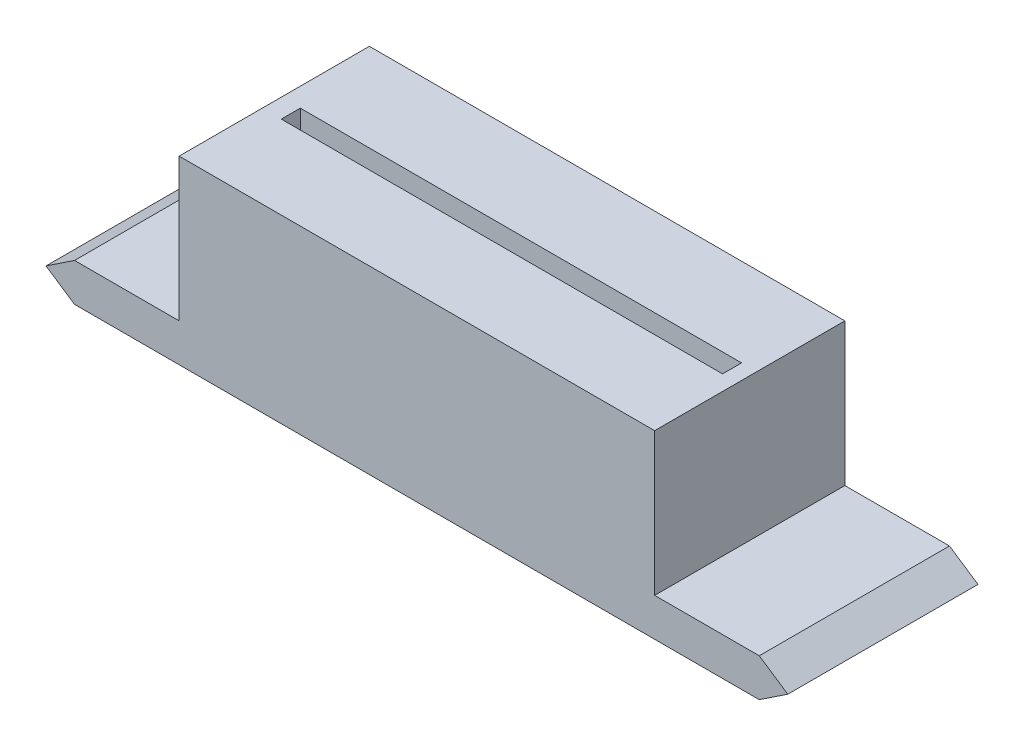
ISO-10303-21;
HEADER;
FILE_DESCRIPTION(('STEP AP214'),'2;1');
FILE_NAME('part.step','',(''),(''),'','','');
FILE_SCHEMA(('AUTOMOTIVE_DESIGN { 1 0 10303 214 1 1 1 1 }'));
ENDSEC;
DATA;
#1=APPLICATION_CONTEXT('core data for automotive mechanical design processes');
#2=APPLICATION_PROTOCOL_DEFINITION('international standard','automotive_design',2000,#1);
#3=PRODUCT_CONTEXT('',#1,'mechanical');
#4=PRODUCT('Part','Part','',(#3));
#5=PRODUCT_RELATED_PRODUCT_CATEGORY('part','',(#4));
#6=PRODUCT_DEFINITION_FORMATION('','',#4);
#7=PRODUCT_DEFINITION_CONTEXT('part definition',#1,'design');
#8=PRODUCT_DEFINITION('design','',#6,#7);
#9=PRODUCT_DEFINITION_SHAPE('','',#8);
#10=(LENGTH_UNIT() NAMED_UNIT(*) SI_UNIT(.MILLI.,.METRE.));
#11=(NAMED_UNIT(*) PLANE_ANGLE_UNIT() SI_UNIT($,.RADIAN.));
#12=(NAMED_UNIT(*) SI_UNIT($,.STERADIAN.) SOLID_ANGLE_UNIT());
#13=UNCERTAINTY_MEASURE_WITH_UNIT(LENGTH_MEASURE(1.E-05),#10,'distance_accuracy_value','');
#14=(GEOMETRIC_REPRESENTATION_CONTEXT(3) GLOBAL_UNCERTAINTY_ASSIGNED_CONTEXT((#13)) GLOBAL_UNIT_ASSIGNED_CONTEXT((#10,
#11,#12)) REPRESENTATION_CONTEXT('',''));
#15=CARTESIAN_POINT('',(0.,0.,0.));
#16=DIRECTION('',(0.,0.,1.));
#17=DIRECTION('',(1.,0.,0.));
#18=AXIS2_PLACEMENT_3D('',#15,#16,#17);
#19=CARTESIAN_POINT('',(-43.1567442914303,0.785295023977495,5.));
#20=DIRECTION('',(0.,-1.,0.));
#21=DIRECTION('',(0.,0.,-1.));
#22=AXIS2_PLACEMENT_3D('',#19,#20,#21);
#23=PLANE('',#22);
#24=DIRECTION('',(0.,0.,1.));
#25=VECTOR('',#24,1.);
#26=CARTESIAN_POINT('',(-45.6567442914303,0.785295023977496,4.62992775799859));
#27=LINE('',#26,#25);
#28=CARTESIAN_POINT('',(-45.6567442914303,0.785295023977496,4.62992775799859));
#29=VERTEX_POINT('',#28);
#30=CARTESIAN_POINT('',(-45.6567442914303,0.785295023977496,5.62992775799859));
#31=VERTEX_POINT('',#30);
#32=EDGE_CURVE('E48',#29,#31,#27,.T.);
#33=ORIENTED_EDGE('',*,*,#32,.T.);
#34=DIRECTION('',(1.,0.,0.));
#35=VECTOR('',#34,1.);
#36=CARTESIAN_POINT('',(-45.6567442914303,0.785295023977496,5.62992775799859));
#37=LINE('',#36,#35);
#38=CARTESIAN_POINT('',(-40.6342076673745,0.785295023977496,5.62992775799859));
#39=VERTEX_POINT('',#38);
#40=EDGE_CURVE('E186',#31,#39,#37,.T.);
#41=ORIENTED_EDGE('',*,*,#40,.T.);
#42=CARTESIAN_POINT('',(-43.1567442914303,0.785295023977495,5.));
#43=DIRECTION('',(0.,-1.,0.));
#44=DIRECTION('',(0.,0.,-1.));
#45=AXIS2_PLACEMENT_3D('',#42,#43,#44);
#46=CIRCLE('',#45,2.6);
#47=CARTESIAN_POINT('',(-40.5832162586123,0.785295023977496,4.62992775799859));
#48=VERTEX_POINT('',#47);
#49=EDGE_CURVE('E226',#39,#48,#46,.T.);
#50=ORIENTED_EDGE('',*,*,#49,.T.);
#51=DIRECTION('',(-1.,0.,0.));
#52=VECTOR('',#51,1.);
#53=CARTESIAN_POINT('',(-45.6567442914303,0.785295023977496,4.62992775799859));
#54=LINE('',#53,#52);
#55=EDGE_CURVE('E196',#48,#29,#54,.T.);
#56=ORIENTED_EDGE('',*,*,#55,.T.);
#57=EDGE_LOOP('',(#33,#41,#50,#56));
#58=FACE_BOUND('',#57,.T.);
#59=ADVANCED_FACE('F33',(#58),#23,.T.);
#60=CARTESIAN_POINT('',(-37.1467442914303,0.785295023977495,5.00000000000004));
#61=DIRECTION('',(0.,-1.,0.));
#62=DIRECTION('',(0.,0.,-1.));
#63=AXIS2_PLACEMENT_3D('',#60,#61,#62);
#64=PLANE('',#63);
#65=CARTESIAN_POINT('',(-37.1467442914303,0.785295023977495,5.00000000000004));
#66=DIRECTION('',(0.,-1.,0.));
#67=DIRECTION('',(0.,0.,-1.));
#68=AXIS2_PLACEMENT_3D('',#65,#66,#67);
#69=CIRCLE('',#68,2.6);
#70=CARTESIAN_POINT('',(-34.6242076673745,0.785295023977497,5.62992775799859));
#71=VERTEX_POINT('',#70);
#72=CARTESIAN_POINT('',(-39.6692809154861,0.785295023977496,5.62992775799859));
#73=VERTEX_POINT('',#72);
#74=EDGE_CURVE('E232',#71,#73,#69,.T.);
#75=ORIENTED_EDGE('',*,*,#74,.T.);
#76=EDGE_CURVE('E499',#73,#71,#37,.T.);
#77=ORIENTED_EDGE('',*,*,#76,.T.);
#78=EDGE_LOOP('',(#75,#77));
#79=FACE_BOUND('',#78,.T.);
#80=ADVANCED_FACE('F401',(#79),#64,.T.);
#81=CARTESIAN_POINT('',(-39.7202723242483,0.785295023977495,4.62992775799859));
#82=VERTEX_POINT('',#81);
#83=CARTESIAN_POINT('',(-34.5732162586123,0.785295023977497,4.62992775799859));
#84=VERTEX_POINT('',#83);
#85=EDGE_CURVE('E233',#82,#84,#69,.T.);
#86=ORIENTED_EDGE('',*,*,#85,.T.);
#87=EDGE_CURVE('E535',#84,#82,#54,.T.);
#88=ORIENTED_EDGE('',*,*,#87,.T.);
#89=EDGE_LOOP('',(#86,#88));
#90=FACE_BOUND('',#89,.T.);
#91=ADVANCED_FACE('F407',(#90),#64,.T.);
#92=CARTESIAN_POINT('',(-31.1367442914303,0.785295023977495,5.00000000000008));
#93=DIRECTION('',(0.,-1.,0.));
#94=DIRECTION('',(0.,0.,-1.));
#95=AXIS2_PLACEMENT_3D('',#92,#93,#94);
#96=PLANE('',#95);
#97=CARTESIAN_POINT('',(-31.1367442914303,0.785295023977495,5.00000000000008));
#98=DIRECTION('',(0.,-1.,0.));
#99=DIRECTION('',(0.,0.,-1.));
#100=AXIS2_PLACEMENT_3D('',#97,#98,#99);
#101=CIRCLE('',#100,2.60000000000001);
#102=CARTESIAN_POINT('',(-28.6142076673745,0.785295023977498,5.62992775799859));
#103=VERTEX_POINT('',#102);
#104=CARTESIAN_POINT('',(-33.6592809154861,0.785295023977497,5.62992775799859));
#105=VERTEX_POINT('',#104);
#106=EDGE_CURVE('E240',#103,#105,#101,.T.);
#107=ORIENTED_EDGE('',*,*,#106,.T.);
#108=EDGE_CURVE('E504',#105,#103,#37,.T.);
#109=ORIENTED_EDGE('',*,*,#108,.T.);
#110=EDGE_LOOP('',(#107,#109));
#111=FACE_BOUND('',#110,.T.);
#112=ADVANCED_FACE('F423',(#111),#96,.T.);
#113=CARTESIAN_POINT('',(-33.7102723242483,0.785295023977495,4.62992775799859));
#114=VERTEX_POINT('',#113);
#115=CARTESIAN_POINT('',(-28.5632162586123,0.785295023977498,4.62992775799859));
#116=VERTEX_POINT('',#115);
#117=EDGE_CURVE('E241',#114,#116,#101,.T.);
#118=ORIENTED_EDGE('',*,*,#117,.T.);
#119=EDGE_CURVE('E528',#116,#114,#54,.T.);
#120=ORIENTED_EDGE('',*,*,#119,.T.);
#121=EDGE_LOOP('',(#118,#120));
#122=FACE_BOUND('',#121,.T.);
#123=ADVANCED_FACE('F426',(#122),#96,.T.);
#124=CARTESIAN_POINT('',(-25.1267442914303,0.785295023977495,5.00000000000013));
#125=DIRECTION('',(0.,-1.,0.));
#126=DIRECTION('',(0.,0.,-1.));
#127=AXIS2_PLACEMENT_3D('',#124,#125,#126);
#128=PLANE('',#127);
#129=CARTESIAN_POINT('',(-25.1267442914303,0.785295023977495,5.00000000000013));
#130=DIRECTION('',(0.,-1.,0.));
#131=DIRECTION('',(0.,0.,-1.));
#132=AXIS2_PLACEMENT_3D('',#129,#130,#131);
#133=CIRCLE('',#132,2.6);
#134=CARTESIAN_POINT('',(-22.6042076673745,0.785295023977499,5.62992775799859));
#135=VERTEX_POINT('',#134);
#136=CARTESIAN_POINT('',(-27.6492809154862,0.785295023977498,5.62992775799859));
#137=VERTEX_POINT('',#136);
#138=EDGE_CURVE('E247',#135,#137,#133,.T.);
#139=ORIENTED_EDGE('',*,*,#138,.T.);
#140=EDGE_CURVE('E513',#137,#135,#37,.T.);
#141=ORIENTED_EDGE('',*,*,#140,.T.);
#142=EDGE_LOOP('',(#139,#141));
#143=FACE_BOUND('',#142,.T.);
#144=ADVANCED_FACE('F432',(#143),#128,.T.);
#145=CARTESIAN_POINT('',(-27.7002723242483,0.785295023977495,4.62992775799859));
#146=VERTEX_POINT('',#145);
#147=CARTESIAN_POINT('',(-22.5532162586123,0.785295023977499,4.62992775799859));
#148=VERTEX_POINT('',#147);
#149=EDGE_CURVE('E248',#146,#148,#133,.T.);
#150=ORIENTED_EDGE('',*,*,#149,.T.);
#151=EDGE_CURVE('E192',#148,#146,#54,.T.);
#152=ORIENTED_EDGE('',*,*,#151,.T.);
#153=EDGE_LOOP('',(#150,#152));
#154=FACE_BOUND('',#153,.T.);
#155=ADVANCED_FACE('F435',(#154),#128,.T.);
#156=CARTESIAN_POINT('',(-52.1567442914303,-5.7147049760225,10.));
#157=DIRECTION('',(0.554700196225229,-0.832050294337844,0.));
#158=DIRECTION('',(0.832050294337844,0.554700196225229,0.));
#159=AXIS2_PLACEMENT_3D('',#156,#157,#158);
#160=PLANE('',#159);
#161=DIRECTION('',(-0.832050294337844,-0.554700196225229,0.));
#162=VECTOR('',#161,1.);
#163=CARTESIAN_POINT('',(-52.1567442914303,-5.7147049760225,0.));
#164=LINE('',#163,#162);
#165=CARTESIAN_POINT('',(-52.1567442914303,-5.7147049760225,0.));
#166=VERTEX_POINT('',#165);
#167=CARTESIAN_POINT('',(-53.6567442914303,-6.7147049760225,0.));
#168=VERTEX_POINT('',#167);
#169=EDGE_CURVE('E255',#166,#168,#164,.T.);
#170=ORIENTED_EDGE('',*,*,#169,.T.);
#171=DIRECTION('',(0.,0.,-1.));
#172=VECTOR('',#171,1.);
#173=CARTESIAN_POINT('',(-53.6567442914303,-6.7147049760225,10.));
#174=LINE('',#173,#172);
#175=CARTESIAN_POINT('',(-53.6567442914303,-6.7147049760225,10.));
#176=VERTEX_POINT('',#175);
#177=EDGE_CURVE('E11',#176,#168,#174,.T.);
#178=ORIENTED_EDGE('',*,*,#177,.F.);
#179=DIRECTION('',(-0.832050294337844,-0.554700196225229,0.));
#180=VECTOR('',#179,1.);
#181=CARTESIAN_POINT('',(-52.1567442914303,-5.7147049760225,10.));
#182=LINE('',#181,#180);
#183=CARTESIAN_POINT('',(-52.1567442914303,-5.7147049760225,10.));
#184=VERTEX_POINT('',#183);
#185=EDGE_CURVE('E276',#184,#176,#182,.T.);
#186=ORIENTED_EDGE('',*,*,#185,.F.);
#187=DIRECTION('',(0.,0.,-1.));
#188=VECTOR('',#187,1.);
#189=CARTESIAN_POINT('',(-52.1567442914303,-5.7147049760225,10.));
#190=LINE('',#189,#188);
#191=EDGE_CURVE('E298',#184,#166,#190,.T.);
#192=ORIENTED_EDGE('',*,*,#191,.T.);
#193=EDGE_LOOP('',(#170,#178,#186,#192));
#194=FACE_BOUND('',#193,.T.);
#195=ADVANCED_FACE('F35',(#194),#160,.F.);
#196=CARTESIAN_POINT('',(-53.6567442914303,-6.7147049760225,10.));
#197=DIRECTION('',(0.554700196225229,0.832050294337844,0.));
#198=DIRECTION('',(-0.832050294337844,0.554700196225229,0.));
#199=AXIS2_PLACEMENT_3D('',#196,#197,#198);
#200=PLANE('',#199);
#201=DIRECTION('',(0.832050294337844,-0.554700196225229,0.));
#202=VECTOR('',#201,1.);
#203=CARTESIAN_POINT('',(-53.6567442914303,-6.7147049760225,0.));
#204=LINE('',#203,#202);
#205=CARTESIAN_POINT('',(-52.1567442914303,-7.7147049760225,0.));
#206=VERTEX_POINT('',#205);
#207=EDGE_CURVE('E301',#168,#206,#204,.T.);
#208=ORIENTED_EDGE('',*,*,#207,.T.);
#209=DIRECTION('',(0.,0.,-1.));
#210=VECTOR('',#209,1.);
#211=CARTESIAN_POINT('',(-52.1567442914303,-7.7147049760225,10.));
#212=LINE('',#211,#210);
#213=CARTESIAN_POINT('',(-52.1567442914303,-7.7147049760225,10.));
#214=VERTEX_POINT('',#213);
#215=EDGE_CURVE('E41',#214,#206,#212,.T.);
#216=ORIENTED_EDGE('',*,*,#215,.F.);
#217=DIRECTION('',(0.832050294337844,-0.554700196225229,0.));
#218=VECTOR('',#217,1.);
#219=CARTESIAN_POINT('',(-53.6567442914303,-6.7147049760225,10.));
#220=LINE('',#219,#218);
#221=EDGE_CURVE('E279',#176,#214,#220,.T.);
#222=ORIENTED_EDGE('',*,*,#221,.F.);
#223=ORIENTED_EDGE('',*,*,#177,.T.);
#224=EDGE_LOOP('',(#208,#216,#222,#223));
#225=FACE_BOUND('',#224,.T.);
#226=ADVANCED_FACE('F368',(#225),#200,.F.);
#227=CARTESIAN_POINT('',(-52.1567442914303,-7.7147049760225,10.));
#228=DIRECTION('',(0.,1.,0.));
#229=DIRECTION('',(0.,0.,1.));
#230=AXIS2_PLACEMENT_3D('',#227,#228,#229);
#231=PLANE('',#230);
#232=CARTESIAN_POINT('',(-43.1567442914303,-7.7147049760225,5.));
#233=DIRECTION('',(0.,-1.,0.));
#234=DIRECTION('',(0.,0.,-1.));
#235=AXIS2_PLACEMENT_3D('',#232,#233,#234);
#236=CIRCLE('',#235,3.);
#237=CARTESIAN_POINT('',(-43.1567442914303,-7.7147049760225,2.));
#238=VERTEX_POINT('',#237);
#239=EDGE_CURVE('E256',#238,#238,#236,.T.);
#240=ORIENTED_EDGE('',*,*,#239,.F.);
#241=EDGE_LOOP('',(#240));
#242=FACE_BOUND('',#241,.T.);
#243=CARTESIAN_POINT('',(-37.1467442914303,-7.7147049760225,5.00000000000004));
#244=DIRECTION('',(0.,-1.,0.));
#245=DIRECTION('',(0.,0.,-1.));
#246=AXIS2_PLACEMENT_3D('',#243,#244,#245);
#247=CIRCLE('',#246,3.);
#248=CARTESIAN_POINT('',(-37.1467442914303,-7.7147049760225,2.00000000000004));
#249=VERTEX_POINT('',#248);
#250=EDGE_CURVE('E262',#249,#249,#247,.T.);
#251=ORIENTED_EDGE('',*,*,#250,.F.);
#252=EDGE_LOOP('',(#251));
#253=FACE_BOUND('',#252,.T.);
#254=CARTESIAN_POINT('',(-31.1367442914303,-7.7147049760225,5.00000000000008));
#255=DIRECTION('',(0.,-1.,0.));
#256=DIRECTION('',(0.,0.,-1.));
#257=AXIS2_PLACEMENT_3D('',#254,#255,#256);
#258=CIRCLE('',#257,3.);
#259=CARTESIAN_POINT('',(-31.1367442914303,-7.7147049760225,2.00000000000009));
#260=VERTEX_POINT('',#259);
#261=EDGE_CURVE('E268',#260,#260,#258,.T.);
#262=ORIENTED_EDGE('',*,*,#261,.F.);
#263=EDGE_LOOP('',(#262));
#264=FACE_BOUND('',#263,.T.);
#265=CARTESIAN_POINT('',(-25.1267442914303,-7.7147049760225,5.00000000000013));
#266=DIRECTION('',(0.,-1.,0.));
#267=DIRECTION('',(0.,0.,-1.));
#268=AXIS2_PLACEMENT_3D('',#265,#266,#267);
#269=CIRCLE('',#268,3.);
#270=CARTESIAN_POINT('',(-25.1267442914303,-7.7147049760225,2.00000000000012));
#271=VERTEX_POINT('',#270);
#272=EDGE_CURVE('E225',#271,#271,#269,.T.);
#273=ORIENTED_EDGE('',*,*,#272,.F.);
#274=EDGE_LOOP('',(#273));
#275=FACE_BOUND('',#274,.T.);
#276=DIRECTION('',(1.,0.,0.));
#277=VECTOR('',#276,1.);
#278=CARTESIAN_POINT('',(-52.1567442914303,-7.7147049760225,0.));
#279=LINE('',#278,#277);
#280=CARTESIAN_POINT('',(-16.1567442914303,-7.7147049760225,0.));
#281=VERTEX_POINT('',#280);
#282=EDGE_CURVE('E303',#206,#281,#279,.T.);
#283=ORIENTED_EDGE('',*,*,#282,.T.);
#284=DIRECTION('',(0.,0.,-1.));
#285=VECTOR('',#284,1.);
#286=CARTESIAN_POINT('',(-16.1567442914303,-7.7147049760225,10.));
#287=LINE('',#286,#285);
#288=CARTESIAN_POINT('',(-16.1567442914303,-7.7147049760225,10.));
#289=VERTEX_POINT('',#288);
#290=EDGE_CURVE('E338',#289,#281,#287,.T.);
#291=ORIENTED_EDGE('',*,*,#290,.F.);
#292=DIRECTION('',(1.,0.,0.));
#293=VECTOR('',#292,1.);
#294=CARTESIAN_POINT('',(-52.1567442914303,-7.7147049760225,10.));
#295=LINE('',#294,#293);
#296=EDGE_CURVE('E282',#214,#289,#295,.T.);
#297=ORIENTED_EDGE('',*,*,#296,.F.);
#298=ORIENTED_EDGE('',*,*,#215,.T.);
#299=EDGE_LOOP('',(#283,#291,#297,#298));
#300=FACE_BOUND('',#299,.T.);
#301=ADVANCED_FACE('F345',(#242,#253,#264,#275,#300),#231,.F.);
#302=CARTESIAN_POINT('',(-16.1567442914303,-7.7147049760225,10.));
#303=DIRECTION('',(-0.55470019622523,0.832050294337843,0.));
#304=DIRECTION('',(-0.832050294337843,-0.55470019622523,0.));
#305=AXIS2_PLACEMENT_3D('',#302,#303,#304);
#306=PLANE('',#305);
#307=DIRECTION('',(0.832050294337843,0.55470019622523,0.));
#308=VECTOR('',#307,1.);
#309=CARTESIAN_POINT('',(-16.1567442914303,-7.7147049760225,0.));
#310=LINE('',#309,#308);
#311=CARTESIAN_POINT('',(-14.6567442914303,-6.7147049760225,0.));
#312=VERTEX_POINT('',#311);
#313=EDGE_CURVE('E305',#281,#312,#310,.T.);
#314=ORIENTED_EDGE('',*,*,#313,.T.);
#315=DIRECTION('',(0.,0.,-1.));
#316=VECTOR('',#315,1.);
#317=CARTESIAN_POINT('',(-14.6567442914303,-6.7147049760225,10.));
#318=LINE('',#317,#316);
#319=CARTESIAN_POINT('',(-14.6567442914303,-6.7147049760225,10.));
#320=VERTEX_POINT('',#319);
#321=EDGE_CURVE('E335',#320,#312,#318,.T.);
#322=ORIENTED_EDGE('',*,*,#321,.F.);
#323=DIRECTION('',(0.832050294337843,0.55470019622523,0.));
#324=VECTOR('',#323,1.);
#325=CARTESIAN_POINT('',(-16.1567442914303,-7.7147049760225,10.));
#326=LINE('',#325,#324);
#327=EDGE_CURVE('E284',#289,#320,#326,.T.);
#328=ORIENTED_EDGE('',*,*,#327,.F.);
#329=ORIENTED_EDGE('',*,*,#290,.T.);
#330=EDGE_LOOP('',(#314,#322,#328,#329));
#331=FACE_BOUND('',#330,.T.);
#332=ADVANCED_FACE('F356',(#331),#306,.F.);
#333=CARTESIAN_POINT('',(-14.6567442914303,-6.7147049760225,10.));
#334=DIRECTION('',(-0.55470019622523,-0.832050294337843,0.));
#335=DIRECTION('',(0.832050294337843,-0.55470019622523,0.));
#336=AXIS2_PLACEMENT_3D('',#333,#334,#335);
#337=PLANE('',#336);
#338=DIRECTION('',(-0.832050294337843,0.55470019622523,0.));
#339=VECTOR('',#338,1.);
#340=CARTESIAN_POINT('',(-14.6567442914303,-6.7147049760225,0.));
#341=LINE('',#340,#339);
#342=CARTESIAN_POINT('',(-16.1567442914303,-5.7147049760225,0.));
#343=VERTEX_POINT('',#342);
#344=EDGE_CURVE('E307',#312,#343,#341,.T.);
#345=ORIENTED_EDGE('',*,*,#344,.T.);
#346=DIRECTION('',(0.,0.,-1.));
#347=VECTOR('',#346,1.);
#348=CARTESIAN_POINT('',(-16.1567442914303,-5.7147049760225,10.));
#349=LINE('',#348,#347);
#350=CARTESIAN_POINT('',(-16.1567442914303,-5.7147049760225,10.));
#351=VERTEX_POINT('',#350);
#352=EDGE_CURVE('E332',#351,#343,#349,.T.);
#353=ORIENTED_EDGE('',*,*,#352,.F.);
#354=DIRECTION('',(-0.832050294337843,0.55470019622523,0.));
#355=VECTOR('',#354,1.);
#356=CARTESIAN_POINT('',(-14.6567442914303,-6.7147049760225,10.));
#357=LINE('',#356,#355);
#358=EDGE_CURVE('E286',#320,#351,#357,.T.);
#359=ORIENTED_EDGE('',*,*,#358,.F.);
#360=ORIENTED_EDGE('',*,*,#321,.T.);
#361=EDGE_LOOP('',(#345,#353,#359,#360));
#362=FACE_BOUND('',#361,.T.);
#363=ADVANCED_FACE('F360',(#362),#337,.F.);
#364=CARTESIAN_POINT('',(-16.1567442914303,-5.7147049760225,10.));
#365=DIRECTION('',(0.,-1.,0.));
#366=DIRECTION('',(1.,0.,0.));
#367=AXIS2_PLACEMENT_3D('',#364,#365,#366);
#368=PLANE('',#367);
#369=DIRECTION('',(-1.,0.,0.));
#370=VECTOR('',#369,1.);
#371=CARTESIAN_POINT('',(-16.1567442914303,-5.7147049760225,0.));
#372=LINE('',#371,#370);
#373=CARTESIAN_POINT('',(-21.6567442914303,-5.7147049760225,0.));
#374=VERTEX_POINT('',#373);
#375=EDGE_CURVE('E309',#343,#374,#372,.T.);
#376=ORIENTED_EDGE('',*,*,#375,.T.);
#377=DIRECTION('',(0.,0.,-1.));
#378=VECTOR('',#377,1.);
#379=CARTESIAN_POINT('',(-21.6567442914303,-5.7147049760225,10.));
#380=LINE('',#379,#378);
#381=CARTESIAN_POINT('',(-21.6567442914303,-5.7147049760225,10.));
#382=VERTEX_POINT('',#381);
#383=EDGE_CURVE('E329',#382,#374,#380,.T.);
#384=ORIENTED_EDGE('',*,*,#383,.F.);
#385=DIRECTION('',(-1.,0.,0.));
#386=VECTOR('',#385,1.);
#387=CARTESIAN_POINT('',(-16.1567442914303,-5.7147049760225,10.));
#388=LINE('',#387,#386);
#389=EDGE_CURVE('E288',#351,#382,#388,.T.);
#390=ORIENTED_EDGE('',*,*,#389,.F.);
#391=ORIENTED_EDGE('',*,*,#352,.T.);
#392=EDGE_LOOP('',(#376,#384,#390,#391));
#393=FACE_BOUND('',#392,.T.);
#394=ADVANCED_FACE('F391',(#393),#368,.F.);
#395=CARTESIAN_POINT('',(-21.6567442914303,-5.7147049760225,10.));
#396=DIRECTION('',(-1.,0.,0.));
#397=DIRECTION('',(0.,0.,1.));
#398=AXIS2_PLACEMENT_3D('',#395,#396,#397);
#399=PLANE('',#398);
#400=DIRECTION('',(0.,1.,0.));
#401=VECTOR('',#400,1.);
#402=CARTESIAN_POINT('',(-21.6567442914303,-5.7147049760225,0.));
#403=LINE('',#402,#401);
#404=CARTESIAN_POINT('',(-21.6567442914303,1.7852950239775,0.));
#405=VERTEX_POINT('',#404);
#406=EDGE_CURVE('E311',#374,#405,#403,.T.);
#407=ORIENTED_EDGE('',*,*,#406,.T.);
#408=DIRECTION('',(0.,0.,-1.));
#409=VECTOR('',#408,1.);
#410=CARTESIAN_POINT('',(-21.6567442914303,1.7852950239775,10.));
#411=LINE('',#410,#409);
#412=CARTESIAN_POINT('',(-21.6567442914303,1.7852950239775,10.));
#413=VERTEX_POINT('',#412);
#414=EDGE_CURVE('E326',#413,#405,#411,.T.);
#415=ORIENTED_EDGE('',*,*,#414,.F.);
#416=DIRECTION('',(0.,1.,0.));
#417=VECTOR('',#416,1.);
#418=CARTESIAN_POINT('',(-21.6567442914303,-5.7147049760225,10.));
#419=LINE('',#418,#417);
#420=EDGE_CURVE('E290',#382,#413,#419,.T.);
#421=ORIENTED_EDGE('',*,*,#420,.F.);
#422=ORIENTED_EDGE('',*,*,#383,.T.);
#423=EDGE_LOOP('',(#407,#415,#421,#422));
#424=FACE_BOUND('',#423,.T.);
#425=ADVANCED_FACE('F388',(#424),#399,.F.);
#426=CARTESIAN_POINT('',(-21.6567442914303,1.7852950239775,10.));
#427=DIRECTION('',(0.,-1.,0.));
#428=DIRECTION('',(1.,0.,0.));
#429=AXIS2_PLACEMENT_3D('',#426,#427,#428);
#430=PLANE('',#429);
#431=DIRECTION('',(-1.,0.,0.));
#432=VECTOR('',#431,1.);
#433=CARTESIAN_POINT('',(-45.6567442914303,1.7852950239775,4.62992775799859));
#434=LINE('',#433,#432);
#435=CARTESIAN_POINT('',(-22.4567442914303,1.7852950239775,4.62992775799859));
#436=VERTEX_POINT('',#435);
#437=CARTESIAN_POINT('',(-45.6567442914303,1.7852950239775,4.62992775799859));
#438=VERTEX_POINT('',#437);
#439=EDGE_CURVE('E213',#436,#438,#434,.T.);
#440=ORIENTED_EDGE('',*,*,#439,.F.);
#441=DIRECTION('',(0.,0.,-1.));
#442=VECTOR('',#441,1.);
#443=CARTESIAN_POINT('',(-22.4567442914303,1.7852950239775,4.62992775799859));
#444=LINE('',#443,#442);
#445=CARTESIAN_POINT('',(-22.4567442914303,1.7852950239775,5.62992775799859));
#446=VERTEX_POINT('',#445);
#447=EDGE_CURVE('E182',#446,#436,#444,.T.);
#448=ORIENTED_EDGE('',*,*,#447,.F.);
#449=DIRECTION('',(1.,0.,0.));
#450=VECTOR('',#449,1.);
#451=CARTESIAN_POINT('',(-45.6567442914303,1.7852950239775,5.62992775799859));
#452=LINE('',#451,#450);
#453=CARTESIAN_POINT('',(-45.6567442914303,1.7852950239775,5.62992775799859));
#454=VERTEX_POINT('',#453);
#455=EDGE_CURVE('E201',#454,#446,#452,.T.);
#456=ORIENTED_EDGE('',*,*,#455,.F.);
#457=DIRECTION('',(0.,0.,1.));
#458=VECTOR('',#457,1.);
#459=CARTESIAN_POINT('',(-45.6567442914303,1.7852950239775,4.62992775799859));
#460=LINE('',#459,#458);
#461=EDGE_CURVE('E205',#438,#454,#460,.T.);
#462=ORIENTED_EDGE('',*,*,#461,.F.);
#463=EDGE_LOOP('',(#440,#448,#456,#462));
#464=FACE_BOUND('',#463,.T.);
#465=DIRECTION('',(-1.,0.,0.));
#466=VECTOR('',#465,1.);
#467=CARTESIAN_POINT('',(-21.6567442914303,1.7852950239775,0.));
#468=LINE('',#467,#466);
#469=CARTESIAN_POINT('',(-46.6567442914303,1.7852950239775,0.));
#470=VERTEX_POINT('',#469);
#471=EDGE_CURVE('E313',#405,#470,#468,.T.);
#472=ORIENTED_EDGE('',*,*,#471,.T.);
#473=DIRECTION('',(0.,0.,-1.));
#474=VECTOR('',#473,1.);
#475=CARTESIAN_POINT('',(-46.6567442914303,1.7852950239775,10.));
#476=LINE('',#475,#474);
#477=CARTESIAN_POINT('',(-46.6567442914303,1.7852950239775,10.));
#478=VERTEX_POINT('',#477);
#479=EDGE_CURVE('E323',#478,#470,#476,.T.);
#480=ORIENTED_EDGE('',*,*,#479,.F.);
#481=DIRECTION('',(-1.,0.,0.));
#482=VECTOR('',#481,1.);
#483=CARTESIAN_POINT('',(-21.6567442914303,1.7852950239775,10.));
#484=LINE('',#483,#482);
#485=EDGE_CURVE('E292',#413,#478,#484,.T.);
#486=ORIENTED_EDGE('',*,*,#485,.F.);
#487=ORIENTED_EDGE('',*,*,#414,.T.);
#488=EDGE_LOOP('',(#472,#480,#486,#487));
#489=FACE_BOUND('',#488,.T.);
#490=ADVANCED_FACE('F384',(#464,#489),#430,.F.);
#491=CARTESIAN_POINT('',(-46.6567442914303,1.7852950239775,10.));
#492=DIRECTION('',(1.,0.,0.));
#493=DIRECTION('',(0.,0.,-1.));
#494=AXIS2_PLACEMENT_3D('',#491,#492,#493);
#495=PLANE('',#494);
#496=DIRECTION('',(0.,-1.,0.));
#497=VECTOR('',#496,1.);
#498=CARTESIAN_POINT('',(-46.6567442914303,1.7852950239775,0.));
#499=LINE('',#498,#497);
#500=CARTESIAN_POINT('',(-46.6567442914303,-5.7147049760225,0.));
#501=VERTEX_POINT('',#500);
#502=EDGE_CURVE('E315',#470,#501,#499,.T.);
#503=ORIENTED_EDGE('',*,*,#502,.T.);
#504=DIRECTION('',(0.,0.,-1.));
#505=VECTOR('',#504,1.);
#506=CARTESIAN_POINT('',(-46.6567442914303,-5.7147049760225,10.));
#507=LINE('',#506,#505);
#508=CARTESIAN_POINT('',(-46.6567442914303,-5.7147049760225,10.));
#509=VERTEX_POINT('',#508);
#510=EDGE_CURVE('E320',#509,#501,#507,.T.);
#511=ORIENTED_EDGE('',*,*,#510,.F.);
#512=DIRECTION('',(0.,-1.,0.));
#513=VECTOR('',#512,1.);
#514=CARTESIAN_POINT('',(-46.6567442914303,1.7852950239775,10.));
#515=LINE('',#514,#513);
#516=EDGE_CURVE('E294',#478,#509,#515,.T.);
#517=ORIENTED_EDGE('',*,*,#516,.F.);
#518=ORIENTED_EDGE('',*,*,#479,.T.);
#519=EDGE_LOOP('',(#503,#511,#517,#518));
#520=FACE_BOUND('',#519,.T.);
#521=ADVANCED_FACE('F380',(#520),#495,.F.);
#522=CARTESIAN_POINT('',(-46.6567442914303,-5.7147049760225,10.));
#523=DIRECTION('',(0.,-1.,0.));
#524=DIRECTION('',(0.,0.,-1.));
#525=AXIS2_PLACEMENT_3D('',#522,#523,#524);
#526=PLANE('',#525);
#527=DIRECTION('',(-1.,0.,0.));
#528=VECTOR('',#527,1.);
#529=CARTESIAN_POINT('',(-46.6567442914303,-5.7147049760225,0.));
#530=LINE('',#529,#528);
#531=EDGE_CURVE('E280',#501,#166,#530,.T.);
#532=ORIENTED_EDGE('',*,*,#531,.T.);
#533=ORIENTED_EDGE('',*,*,#191,.F.);
#534=DIRECTION('',(-1.,0.,0.));
#535=VECTOR('',#534,1.);
#536=CARTESIAN_POINT('',(-46.6567442914303,-5.7147049760225,10.));
#537=LINE('',#536,#535);
#538=EDGE_CURVE('E296',#509,#184,#537,.T.);
#539=ORIENTED_EDGE('',*,*,#538,.F.);
#540=ORIENTED_EDGE('',*,*,#510,.T.);
#541=EDGE_LOOP('',(#532,#533,#539,#540));
#542=FACE_BOUND('',#541,.T.);
#543=ADVANCED_FACE('F375',(#542),#526,.F.);
#544=CARTESIAN_POINT('',(0.,0.,10.));
#545=DIRECTION('',(0.,0.,1.));
#546=DIRECTION('',(1.,0.,0.));
#547=AXIS2_PLACEMENT_3D('',#544,#545,#546);
#548=PLANE('',#547);
#549=ORIENTED_EDGE('',*,*,#185,.T.);
#550=ORIENTED_EDGE('',*,*,#221,.T.);
#551=ORIENTED_EDGE('',*,*,#296,.T.);
#552=ORIENTED_EDGE('',*,*,#327,.T.);
#553=ORIENTED_EDGE('',*,*,#358,.T.);
#554=ORIENTED_EDGE('',*,*,#389,.T.);
#555=ORIENTED_EDGE('',*,*,#420,.T.);
#556=ORIENTED_EDGE('',*,*,#485,.T.);
#557=ORIENTED_EDGE('',*,*,#516,.T.);
#558=ORIENTED_EDGE('',*,*,#538,.T.);
#559=EDGE_LOOP('',(#549,#550,#551,#552,#553,#554,#555,#556,#557,#558));
#560=FACE_BOUND('',#559,.T.);
#561=ADVANCED_FACE('F364',(#560),#548,.T.);
#562=CARTESIAN_POINT('',(0.,0.,0.));
#563=DIRECTION('',(0.,0.,1.));
#564=DIRECTION('',(1.,0.,0.));
#565=AXIS2_PLACEMENT_3D('',#562,#563,#564);
#566=PLANE('',#565);
#567=ORIENTED_EDGE('',*,*,#169,.F.);
#568=ORIENTED_EDGE('',*,*,#531,.F.);
#569=ORIENTED_EDGE('',*,*,#502,.F.);
#570=ORIENTED_EDGE('',*,*,#471,.F.);
#571=ORIENTED_EDGE('',*,*,#406,.F.);
#572=ORIENTED_EDGE('',*,*,#375,.F.);
#573=ORIENTED_EDGE('',*,*,#344,.F.);
#574=ORIENTED_EDGE('',*,*,#313,.F.);
#575=ORIENTED_EDGE('',*,*,#282,.F.);
#576=ORIENTED_EDGE('',*,*,#207,.F.);
#577=EDGE_LOOP('',(#567,#568,#569,#570,#571,#572,#573,#574,#575,#576));
#578=FACE_BOUND('',#577,.T.);
#579=ADVANCED_FACE('F351',(#578),#566,.F.);
#580=CARTESIAN_POINT('',(-25.1267442914303,-6.7147049760225,5.00000000000013));
#581=DIRECTION('',(0.,-1.,0.));
#582=DIRECTION('',(0.,0.,-1.));
#583=AXIS2_PLACEMENT_3D('',#580,#581,#582);
#584=CYLINDRICAL_SURFACE('',#583,3.);
#585=CARTESIAN_POINT('',(-25.1267442914303,-6.7147049760225,5.00000000000013));
#586=DIRECTION('',(0.,-1.,0.));
#587=DIRECTION('',(0.,0.,-1.));
#588=AXIS2_PLACEMENT_3D('',#585,#586,#587);
#589=CIRCLE('',#588,3.);
#590=CARTESIAN_POINT('',(-25.1267442914303,-6.7147049760225,2.00000000000012));
#591=VERTEX_POINT('',#590);
#592=EDGE_CURVE('E271',#591,#591,#589,.T.);
#593=ORIENTED_EDGE('',*,*,#592,.F.);
#594=EDGE_LOOP('',(#593));
#595=FACE_BOUND('',#594,.T.);
#596=ORIENTED_EDGE('',*,*,#272,.T.);
#597=EDGE_LOOP('',(#596));
#598=FACE_BOUND('',#597,.T.);
#599=ADVANCED_FACE('F467',(#595,#598),#584,.F.);
#600=CARTESIAN_POINT('',(-25.1267442914303,-6.7147049760225,5.00000000000013));
#601=DIRECTION('',(0.,-1.,0.));
#602=DIRECTION('',(0.,0.,-1.));
#603=AXIS2_PLACEMENT_3D('',#600,#601,#602);
#604=PLANE('',#603);
#605=CARTESIAN_POINT('',(-25.1267442914303,-6.7147049760225,5.00000000000013));
#606=DIRECTION('',(0.,-1.,0.));
#607=DIRECTION('',(0.,0.,-1.));
#608=AXIS2_PLACEMENT_3D('',#605,#606,#607);
#609=CIRCLE('',#608,2.6);
#610=CARTESIAN_POINT('',(-25.1267442914303,-6.7147049760225,2.40000000000012));
#611=VERTEX_POINT('',#610);
#612=EDGE_CURVE('E249',#611,#611,#609,.T.);
#613=ORIENTED_EDGE('',*,*,#612,.F.);
#614=EDGE_LOOP('',(#613));
#615=FACE_BOUND('',#614,.T.);
#616=ORIENTED_EDGE('',*,*,#592,.T.);
#617=EDGE_LOOP('',(#616));
#618=FACE_BOUND('',#617,.T.);
#619=ADVANCED_FACE('F463',(#615,#618),#604,.T.);
#620=CARTESIAN_POINT('',(-31.1367442914303,-6.7147049760225,5.00000000000008));
#621=DIRECTION('',(0.,-1.,0.));
#622=DIRECTION('',(0.,0.,-1.));
#623=AXIS2_PLACEMENT_3D('',#620,#621,#622);
#624=CYLINDRICAL_SURFACE('',#623,3.);
#625=CARTESIAN_POINT('',(-31.1367442914303,-6.7147049760225,5.00000000000008));
#626=DIRECTION('',(0.,-1.,0.));
#627=DIRECTION('',(0.,0.,-1.));
#628=AXIS2_PLACEMENT_3D('',#625,#626,#627);
#629=CIRCLE('',#628,3.);
#630=CARTESIAN_POINT('',(-31.1367442914303,-6.7147049760225,2.00000000000009));
#631=VERTEX_POINT('',#630);
#632=EDGE_CURVE('E265',#631,#631,#629,.T.);
#633=ORIENTED_EDGE('',*,*,#632,.F.);
#634=EDGE_LOOP('',(#633));
#635=FACE_BOUND('',#634,.T.);
#636=ORIENTED_EDGE('',*,*,#261,.T.);
#637=EDGE_LOOP('',(#636));
#638=FACE_BOUND('',#637,.T.);
#639=ADVANCED_FACE('F459',(#635,#638),#624,.F.);
#640=CARTESIAN_POINT('',(-31.1367442914303,-6.7147049760225,5.00000000000008));
#641=DIRECTION('',(0.,-1.,0.));
#642=DIRECTION('',(0.,0.,-1.));
#643=AXIS2_PLACEMENT_3D('',#640,#641,#642);
#644=PLANE('',#643);
#645=CARTESIAN_POINT('',(-31.1367442914303,-6.7147049760225,5.00000000000008));
#646=DIRECTION('',(0.,-1.,0.));
#647=DIRECTION('',(0.,0.,-1.));
#648=AXIS2_PLACEMENT_3D('',#645,#646,#647);
#649=CIRCLE('',#648,2.60000000000001);
#650=CARTESIAN_POINT('',(-31.1367442914303,-6.7147049760225,2.40000000000008));
#651=VERTEX_POINT('',#650);
#652=EDGE_CURVE('E242',#651,#651,#649,.T.);
#653=ORIENTED_EDGE('',*,*,#652,.F.);
#654=EDGE_LOOP('',(#653));
#655=FACE_BOUND('',#654,.T.);
#656=ORIENTED_EDGE('',*,*,#632,.T.);
#657=EDGE_LOOP('',(#656));
#658=FACE_BOUND('',#657,.T.);
#659=ADVANCED_FACE('F455',(#655,#658),#644,.T.);
#660=CARTESIAN_POINT('',(-37.1467442914303,-6.7147049760225,5.00000000000004));
#661=DIRECTION('',(0.,-1.,0.));
#662=DIRECTION('',(0.,0.,-1.));
#663=AXIS2_PLACEMENT_3D('',#660,#661,#662);
#664=CYLINDRICAL_SURFACE('',#663,3.);
#665=CARTESIAN_POINT('',(-37.1467442914303,-6.7147049760225,5.00000000000004));
#666=DIRECTION('',(0.,-1.,0.));
#667=DIRECTION('',(0.,0.,-1.));
#668=AXIS2_PLACEMENT_3D('',#665,#666,#667);
#669=CIRCLE('',#668,3.);
#670=CARTESIAN_POINT('',(-37.1467442914303,-6.7147049760225,2.00000000000004));
#671=VERTEX_POINT('',#670);
#672=EDGE_CURVE('E259',#671,#671,#669,.T.);
#673=ORIENTED_EDGE('',*,*,#672,.F.);
#674=EDGE_LOOP('',(#673));
#675=FACE_BOUND('',#674,.T.);
#676=ORIENTED_EDGE('',*,*,#250,.T.);
#677=EDGE_LOOP('',(#676));
#678=FACE_BOUND('',#677,.T.);
#679=ADVANCED_FACE('F451',(#675,#678),#664,.F.);
#680=CARTESIAN_POINT('',(-37.1467442914303,-6.7147049760225,5.00000000000004));
#681=DIRECTION('',(0.,-1.,0.));
#682=DIRECTION('',(0.,0.,-1.));
#683=AXIS2_PLACEMENT_3D('',#680,#681,#682);
#684=PLANE('',#683);
#685=CARTESIAN_POINT('',(-37.1467442914303,-6.7147049760225,5.00000000000004));
#686=DIRECTION('',(0.,-1.,0.));
#687=DIRECTION('',(0.,0.,-1.));
#688=AXIS2_PLACEMENT_3D('',#685,#686,#687);
#689=CIRCLE('',#688,2.6);
#690=CARTESIAN_POINT('',(-37.1467442914303,-6.7147049760225,2.40000000000004));
#691=VERTEX_POINT('',#690);
#692=EDGE_CURVE('E235',#691,#691,#689,.T.);
#693=ORIENTED_EDGE('',*,*,#692,.F.);
#694=EDGE_LOOP('',(#693));
#695=FACE_BOUND('',#694,.T.);
#696=ORIENTED_EDGE('',*,*,#672,.T.);
#697=EDGE_LOOP('',(#696));
#698=FACE_BOUND('',#697,.T.);
#699=ADVANCED_FACE('F447',(#695,#698),#684,.T.);
#700=CARTESIAN_POINT('',(-43.1567442914303,-6.7147049760225,5.));
#701=DIRECTION('',(0.,-1.,0.));
#702=DIRECTION('',(0.,0.,-1.));
#703=AXIS2_PLACEMENT_3D('',#700,#701,#702);
#704=CYLINDRICAL_SURFACE('',#703,3.);
#705=CARTESIAN_POINT('',(-43.1567442914303,-6.7147049760225,5.));
#706=DIRECTION('',(0.,-1.,0.));
#707=DIRECTION('',(0.,0.,-1.));
#708=AXIS2_PLACEMENT_3D('',#705,#706,#707);
#709=CIRCLE('',#708,3.);
#710=CARTESIAN_POINT('',(-43.1567442914303,-6.7147049760225,2.));
#711=VERTEX_POINT('',#710);
#712=EDGE_CURVE('E252',#711,#711,#709,.T.);
#713=ORIENTED_EDGE('',*,*,#712,.F.);
#714=EDGE_LOOP('',(#713));
#715=FACE_BOUND('',#714,.T.);
#716=ORIENTED_EDGE('',*,*,#239,.T.);
#717=EDGE_LOOP('',(#716));
#718=FACE_BOUND('',#717,.T.);
#719=ADVANCED_FACE('F443',(#715,#718),#704,.F.);
#720=CARTESIAN_POINT('',(-43.1567442914303,-6.7147049760225,5.));
#721=DIRECTION('',(0.,-1.,0.));
#722=DIRECTION('',(0.,0.,-1.));
#723=AXIS2_PLACEMENT_3D('',#720,#721,#722);
#724=PLANE('',#723);
#725=CARTESIAN_POINT('',(-43.1567442914303,-6.7147049760225,5.));
#726=DIRECTION('',(0.,-1.,0.));
#727=DIRECTION('',(0.,0.,-1.));
#728=AXIS2_PLACEMENT_3D('',#725,#726,#727);
#729=CIRCLE('',#728,2.6);
#730=CARTESIAN_POINT('',(-43.1567442914303,-6.7147049760225,2.4));
#731=VERTEX_POINT('',#730);
#732=EDGE_CURVE('E227',#731,#731,#729,.T.);
#733=ORIENTED_EDGE('',*,*,#732,.F.);
#734=EDGE_LOOP('',(#733));
#735=FACE_BOUND('',#734,.T.);
#736=ORIENTED_EDGE('',*,*,#712,.T.);
#737=EDGE_LOOP('',(#736));
#738=FACE_BOUND('',#737,.T.);
#739=ADVANCED_FACE('F416',(#735,#738),#724,.T.);
#740=CARTESIAN_POINT('',(-43.1567442914303,0.785295023977495,5.));
#741=DIRECTION('',(0.,-1.,0.));
#742=DIRECTION('',(0.,0.,-1.));
#743=AXIS2_PLACEMENT_3D('',#740,#741,#742);
#744=CYLINDRICAL_SURFACE('',#743,2.6);
#745=EDGE_CURVE('E223',#48,#39,#46,.T.);
#746=ORIENTED_EDGE('',*,*,#745,.F.);
#747=ORIENTED_EDGE('',*,*,#49,.F.);
#748=EDGE_LOOP('',(#746,#747));
#749=FACE_BOUND('',#748,.T.);
#750=ORIENTED_EDGE('',*,*,#732,.T.);
#751=EDGE_LOOP('',(#750));
#752=FACE_BOUND('',#751,.T.);
#753=ADVANCED_FACE('F413',(#749,#752),#744,.F.);
#754=CARTESIAN_POINT('',(-37.1467442914303,0.785295023977495,5.00000000000004));
#755=DIRECTION('',(0.,-1.,0.));
#756=DIRECTION('',(0.,0.,-1.));
#757=AXIS2_PLACEMENT_3D('',#754,#755,#756);
#758=CYLINDRICAL_SURFACE('',#757,2.6);
#759=EDGE_CURVE('E230',#84,#71,#69,.T.);
#760=ORIENTED_EDGE('',*,*,#759,.F.);
#761=ORIENTED_EDGE('',*,*,#85,.F.);
#762=EDGE_CURVE('E234',#73,#82,#69,.T.);
#763=ORIENTED_EDGE('',*,*,#762,.F.);
#764=ORIENTED_EDGE('',*,*,#74,.F.);
#765=EDGE_LOOP('',(#760,#761,#763,#764));
#766=FACE_BOUND('',#765,.T.);
#767=ORIENTED_EDGE('',*,*,#692,.T.);
#768=EDGE_LOOP('',(#767));
#769=FACE_BOUND('',#768,.T.);
#770=ADVANCED_FACE('F415',(#766,#769),#758,.F.);
#771=CARTESIAN_POINT('',(-31.1367442914303,0.785295023977495,5.00000000000008));
#772=DIRECTION('',(0.,-1.,0.));
#773=DIRECTION('',(0.,0.,-1.));
#774=AXIS2_PLACEMENT_3D('',#771,#772,#773);
#775=CYLINDRICAL_SURFACE('',#774,2.60000000000001);
#776=EDGE_CURVE('E238',#116,#103,#101,.T.);
#777=ORIENTED_EDGE('',*,*,#776,.F.);
#778=ORIENTED_EDGE('',*,*,#117,.F.);
#779=EDGE_CURVE('E219',#105,#114,#101,.T.);
#780=ORIENTED_EDGE('',*,*,#779,.F.);
#781=ORIENTED_EDGE('',*,*,#106,.F.);
#782=EDGE_LOOP('',(#777,#778,#780,#781));
#783=FACE_BOUND('',#782,.T.);
#784=ORIENTED_EDGE('',*,*,#652,.T.);
#785=EDGE_LOOP('',(#784));
#786=FACE_BOUND('',#785,.T.);
#787=ADVANCED_FACE('F421',(#783,#786),#775,.F.);
#788=CARTESIAN_POINT('',(-25.1267442914303,0.785295023977495,5.00000000000013));
#789=DIRECTION('',(0.,-1.,0.));
#790=DIRECTION('',(0.,0.,-1.));
#791=AXIS2_PLACEMENT_3D('',#788,#789,#790);
#792=CYLINDRICAL_SURFACE('',#791,2.6);
#793=EDGE_CURVE('E245',#148,#135,#133,.T.);
#794=ORIENTED_EDGE('',*,*,#793,.F.);
#795=ORIENTED_EDGE('',*,*,#149,.F.);
#796=EDGE_CURVE('E524',#137,#146,#133,.T.);
#797=ORIENTED_EDGE('',*,*,#796,.F.);
#798=ORIENTED_EDGE('',*,*,#138,.F.);
#799=EDGE_LOOP('',(#794,#795,#797,#798));
#800=FACE_BOUND('',#799,.T.);
#801=ORIENTED_EDGE('',*,*,#612,.T.);
#802=EDGE_LOOP('',(#801));
#803=FACE_BOUND('',#802,.T.);
#804=ADVANCED_FACE('F430',(#800,#803),#792,.F.);
#805=CARTESIAN_POINT('',(0.,0.785295023977502,0.));
#806=DIRECTION('',(0.,1.,0.));
#807=DIRECTION('',(-1.,0.,0.));
#808=AXIS2_PLACEMENT_3D('',#805,#806,#807);
#809=PLANE('',#808);
#810=ORIENTED_EDGE('',*,*,#745,.T.);
#811=EDGE_CURVE('E211',#39,#73,#37,.T.);
#812=ORIENTED_EDGE('',*,*,#811,.T.);
#813=ORIENTED_EDGE('',*,*,#762,.T.);
#814=EDGE_CURVE('E56',#82,#48,#54,.T.);
#815=ORIENTED_EDGE('',*,*,#814,.T.);
#816=EDGE_LOOP('',(#810,#812,#813,#815));
#817=FACE_BOUND('',#816,.T.);
#818=ADVANCED_FACE('F439',(#817),#809,.T.);
#819=ORIENTED_EDGE('',*,*,#759,.T.);
#820=EDGE_CURVE('E500',#71,#105,#37,.T.);
#821=ORIENTED_EDGE('',*,*,#820,.T.);
#822=ORIENTED_EDGE('',*,*,#779,.T.);
#823=EDGE_CURVE('E531',#114,#84,#54,.T.);
#824=ORIENTED_EDGE('',*,*,#823,.T.);
#825=EDGE_LOOP('',(#819,#821,#822,#824));
#826=FACE_BOUND('',#825,.T.);
#827=ADVANCED_FACE('F546',(#826),#809,.T.);
#828=ORIENTED_EDGE('',*,*,#776,.T.);
#829=EDGE_CURVE('E509',#103,#137,#37,.T.);
#830=ORIENTED_EDGE('',*,*,#829,.T.);
#831=ORIENTED_EDGE('',*,*,#796,.T.);
#832=EDGE_CURVE('E527',#146,#116,#54,.T.);
#833=ORIENTED_EDGE('',*,*,#832,.T.);
#834=EDGE_LOOP('',(#828,#830,#831,#833));
#835=FACE_BOUND('',#834,.T.);
#836=ADVANCED_FACE('F544',(#835),#809,.T.);
#837=ORIENTED_EDGE('',*,*,#793,.T.);
#838=CARTESIAN_POINT('',(-22.4567442914303,0.785295023977499,5.62992775799859));
#839=VERTEX_POINT('',#838);
#840=EDGE_CURVE('E199',#135,#839,#37,.T.);
#841=ORIENTED_EDGE('',*,*,#840,.T.);
#842=DIRECTION('',(0.,0.,-1.));
#843=VECTOR('',#842,1.);
#844=CARTESIAN_POINT('',(-22.4567442914303,0.785295023977499,4.62992775799859));
#845=LINE('',#844,#843);
#846=CARTESIAN_POINT('',(-22.4567442914303,0.785295023977499,4.62992775799859));
#847=VERTEX_POINT('',#846);
#848=EDGE_CURVE('E180',#839,#847,#845,.T.);
#849=ORIENTED_EDGE('',*,*,#848,.T.);
#850=EDGE_CURVE('E189',#847,#148,#54,.T.);
#851=ORIENTED_EDGE('',*,*,#850,.T.);
#852=EDGE_LOOP('',(#837,#841,#849,#851));
#853=FACE_BOUND('',#852,.T.);
#854=ADVANCED_FACE('F197',(#853),#809,.T.);
#855=CARTESIAN_POINT('',(-22.4567442914303,0.785295023977499,4.62992775799859));
#856=DIRECTION('',(1.,0.,0.));
#857=DIRECTION('',(0.,1.,0.));
#858=AXIS2_PLACEMENT_3D('',#855,#856,#857);
#859=PLANE('',#858);
#860=ORIENTED_EDGE('',*,*,#447,.T.);
#861=DIRECTION('',(0.,1.,0.));
#862=VECTOR('',#861,1.);
#863=CARTESIAN_POINT('',(-22.4567442914303,0.785295023977499,4.62992775799859));
#864=LINE('',#863,#862);
#865=EDGE_CURVE('E176',#847,#436,#864,.T.);
#866=ORIENTED_EDGE('',*,*,#865,.F.);
#867=ORIENTED_EDGE('',*,*,#848,.F.);
#868=DIRECTION('',(0.,1.,0.));
#869=VECTOR('',#868,1.);
#870=CARTESIAN_POINT('',(-22.4567442914303,0.785295023977499,5.62992775799859));
#871=LINE('',#870,#869);
#872=EDGE_CURVE('E217',#839,#446,#871,.T.);
#873=ORIENTED_EDGE('',*,*,#872,.T.);
#874=EDGE_LOOP('',(#860,#866,#867,#873));
#875=FACE_BOUND('',#874,.T.);
#876=ADVANCED_FACE('F178',(#875),#859,.F.);
#877=CARTESIAN_POINT('',(-45.6567442914303,0.785295023977496,5.62992775799859));
#878=DIRECTION('',(0.,0.,1.));
#879=DIRECTION('',(1.,0.,0.));
#880=AXIS2_PLACEMENT_3D('',#877,#878,#879);
#881=PLANE('',#880);
#882=ORIENTED_EDGE('',*,*,#455,.T.);
#883=ORIENTED_EDGE('',*,*,#872,.F.);
#884=ORIENTED_EDGE('',*,*,#840,.F.);
#885=ORIENTED_EDGE('',*,*,#140,.F.);
#886=ORIENTED_EDGE('',*,*,#829,.F.);
#887=ORIENTED_EDGE('',*,*,#108,.F.);
#888=ORIENTED_EDGE('',*,*,#820,.F.);
#889=ORIENTED_EDGE('',*,*,#76,.F.);
#890=ORIENTED_EDGE('',*,*,#811,.F.);
#891=ORIENTED_EDGE('',*,*,#40,.F.);
#892=DIRECTION('',(0.,1.,0.));
#893=VECTOR('',#892,1.);
#894=CARTESIAN_POINT('',(-45.6567442914303,0.785295023977496,5.62992775799859));
#895=LINE('',#894,#893);
#896=EDGE_CURVE('E220',#31,#454,#895,.T.);
#897=ORIENTED_EDGE('',*,*,#896,.T.);
#898=EDGE_LOOP('',(#882,#883,#884,#885,#886,#887,#888,#889,#890,#891,#897));
#899=FACE_BOUND('',#898,.T.);
#900=ADVANCED_FACE('F496',(#899),#881,.F.);
#901=CARTESIAN_POINT('',(-45.6567442914303,0.785295023977496,4.62992775799859));
#902=DIRECTION('',(-1.,0.,0.));
#903=DIRECTION('',(0.,-1.,0.));
#904=AXIS2_PLACEMENT_3D('',#901,#902,#903);
#905=PLANE('',#904);
#906=ORIENTED_EDGE('',*,*,#461,.T.);
#907=ORIENTED_EDGE('',*,*,#896,.F.);
#908=ORIENTED_EDGE('',*,*,#32,.F.);
#909=DIRECTION('',(0.,1.,0.));
#910=VECTOR('',#909,1.);
#911=CARTESIAN_POINT('',(-45.6567442914303,0.785295023977496,4.62992775799859));
#912=LINE('',#911,#910);
#913=EDGE_CURVE('E185',#29,#438,#912,.T.);
#914=ORIENTED_EDGE('',*,*,#913,.T.);
#915=EDGE_LOOP('',(#906,#907,#908,#914));
#916=FACE_BOUND('',#915,.T.);
#917=ADVANCED_FACE('F556',(#916),#905,.F.);
#918=CARTESIAN_POINT('',(-45.6567442914303,0.785295023977496,4.62992775799859));
#919=DIRECTION('',(0.,0.,-1.));
#920=DIRECTION('',(-1.,0.,0.));
#921=AXIS2_PLACEMENT_3D('',#918,#919,#920);
#922=PLANE('',#921);
#923=ORIENTED_EDGE('',*,*,#439,.T.);
#924=ORIENTED_EDGE('',*,*,#913,.F.);
#925=ORIENTED_EDGE('',*,*,#55,.F.);
#926=ORIENTED_EDGE('',*,*,#814,.F.);
#927=ORIENTED_EDGE('',*,*,#87,.F.);
#928=ORIENTED_EDGE('',*,*,#823,.F.);
#929=ORIENTED_EDGE('',*,*,#119,.F.);
#930=ORIENTED_EDGE('',*,*,#832,.F.);
#931=ORIENTED_EDGE('',*,*,#151,.F.);
#932=ORIENTED_EDGE('',*,*,#850,.F.);
#933=ORIENTED_EDGE('',*,*,#865,.T.);
#934=EDGE_LOOP('',(#923,#924,#925,#926,#927,#928,#929,#930,#931,#932,#933));
#935=FACE_BOUND('',#934,.T.);
#936=ADVANCED_FACE('F190',(#935),#922,.F.);
#937=CLOSED_SHELL('',(#59,#80,#91,#112,#123,#144,#155,#195,#226,#301,#332,#363,#394,#425,#490,
#521,#543,#561,#579,#599,#619,#639,#659,#679,#699,#719,#739,#753,#770,#787,#804,#818,#827,#836,
#854,#876,#900,#917,#936));
#938=MANIFOLD_SOLID_BREP('B2',#937);
#939=ADVANCED_BREP_SHAPE_REPRESENTATION('',(#18,#938),#14);
#940=SHAPE_DEFINITION_REPRESENTATION(#9,#939);
ENDSEC;
END-ISO-10303-21;
